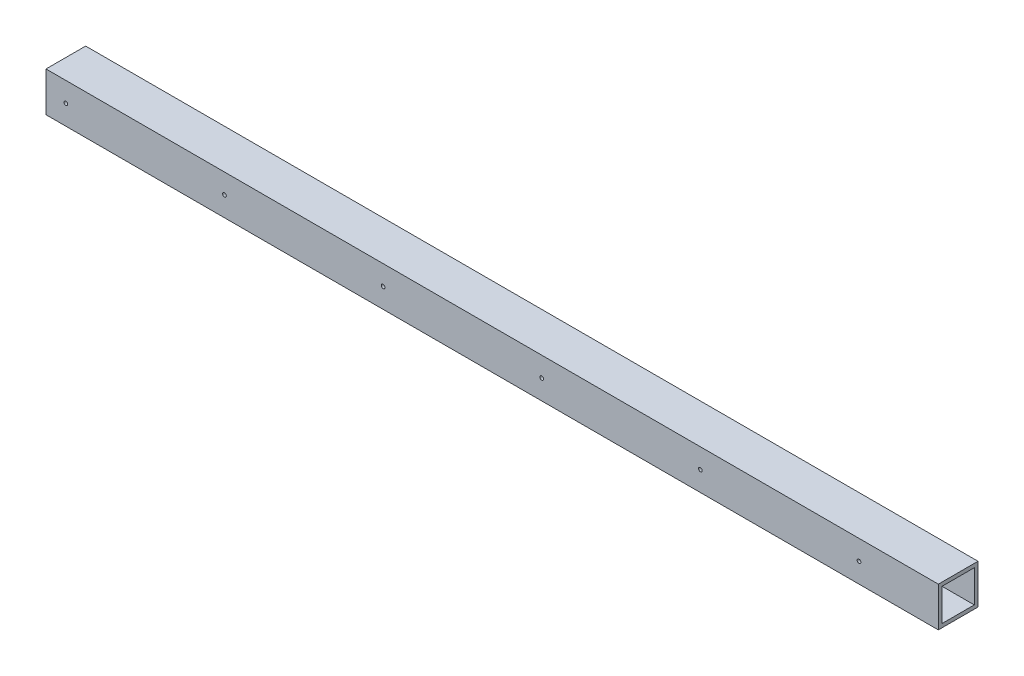
ISO-10303-21;
HEADER;
FILE_DESCRIPTION(('STEP AP214'),'2;1');
FILE_NAME('part.step','',(''),(''),'','','');
FILE_SCHEMA(('AUTOMOTIVE_DESIGN { 1 0 10303 214 1 1 1 1 }'));
ENDSEC;
DATA;
#1=APPLICATION_CONTEXT('core data for automotive mechanical design processes');
#2=APPLICATION_PROTOCOL_DEFINITION('international standard','automotive_design',2000,#1);
#3=PRODUCT_CONTEXT('',#1,'mechanical');
#4=PRODUCT('Part','Part','',(#3));
#5=PRODUCT_RELATED_PRODUCT_CATEGORY('part','',(#4));
#6=PRODUCT_DEFINITION_FORMATION('','',#4);
#7=PRODUCT_DEFINITION_CONTEXT('part definition',#1,'design');
#8=PRODUCT_DEFINITION('design','',#6,#7);
#9=PRODUCT_DEFINITION_SHAPE('','',#8);
#10=(LENGTH_UNIT() NAMED_UNIT(*) SI_UNIT(.MILLI.,.METRE.));
#11=(NAMED_UNIT(*) PLANE_ANGLE_UNIT() SI_UNIT($,.RADIAN.));
#12=(NAMED_UNIT(*) SI_UNIT($,.STERADIAN.) SOLID_ANGLE_UNIT());
#13=UNCERTAINTY_MEASURE_WITH_UNIT(LENGTH_MEASURE(1.E-05),#10,'distance_accuracy_value','');
#14=(GEOMETRIC_REPRESENTATION_CONTEXT(3) GLOBAL_UNCERTAINTY_ASSIGNED_CONTEXT((#13)) GLOBAL_UNIT_ASSIGNED_CONTEXT((#10,
#11,#12)) REPRESENTATION_CONTEXT('',''));
#15=CARTESIAN_POINT('',(0.,0.,0.));
#16=DIRECTION('',(0.,0.,1.));
#17=DIRECTION('',(1.,0.,0.));
#18=AXIS2_PLACEMENT_3D('',#15,#16,#17);
#19=CARTESIAN_POINT('',(25.4000000000001,25.4,0.));
#20=DIRECTION('',(0.,0.,-1.));
#21=DIRECTION('',(-1.,0.,0.));
#22=AXIS2_PLACEMENT_3D('',#19,#20,#21);
#23=CYLINDRICAL_SURFACE('',#22,2.38125000000006);
#24=CARTESIAN_POINT('',(25.4000000000001,25.4,-4.7625));
#25=DIRECTION('',(0.,0.,-1.));
#26=DIRECTION('',(-1.,0.,0.));
#27=AXIS2_PLACEMENT_3D('',#24,#25,#26);
#28=CIRCLE('',#27,2.38125000000006);
#29=CARTESIAN_POINT('',(23.01875,25.4,-4.7625));
#30=VERTEX_POINT('',#29);
#31=EDGE_CURVE('E39',#30,#30,#28,.T.);
#32=ORIENTED_EDGE('',*,*,#31,.T.);
#33=EDGE_LOOP('',(#32));
#34=FACE_BOUND('',#33,.T.);
#35=CARTESIAN_POINT('',(25.4000000000001,25.4,0.));
#36=DIRECTION('',(0.,0.,-1.));
#37=DIRECTION('',(-1.,0.,0.));
#38=AXIS2_PLACEMENT_3D('',#35,#36,#37);
#39=CIRCLE('',#38,2.38125000000006);
#40=CARTESIAN_POINT('',(23.01875,25.4,0.));
#41=VERTEX_POINT('',#40);
#42=EDGE_CURVE('E11',#41,#41,#39,.T.);
#43=ORIENTED_EDGE('',*,*,#42,.F.);
#44=EDGE_LOOP('',(#43));
#45=FACE_BOUND('',#44,.T.);
#46=ADVANCED_FACE('F32',(#34,#45),#23,.F.);
#47=CARTESIAN_POINT('',(228.6,25.4,0.));
#48=DIRECTION('',(0.,0.,-1.));
#49=DIRECTION('',(-1.,0.,0.));
#50=AXIS2_PLACEMENT_3D('',#47,#48,#49);
#51=CYLINDRICAL_SURFACE('',#50,2.38125000000006);
#52=CARTESIAN_POINT('',(228.6,25.4,-4.7625));
#53=DIRECTION('',(0.,0.,-1.));
#54=DIRECTION('',(-1.,0.,0.));
#55=AXIS2_PLACEMENT_3D('',#52,#53,#54);
#56=CIRCLE('',#55,2.38125000000006);
#57=CARTESIAN_POINT('',(226.21875,25.4,-4.7625));
#58=VERTEX_POINT('',#57);
#59=EDGE_CURVE('E205',#58,#58,#56,.T.);
#60=ORIENTED_EDGE('',*,*,#59,.T.);
#61=EDGE_LOOP('',(#60));
#62=FACE_BOUND('',#61,.T.);
#63=CARTESIAN_POINT('',(228.6,25.4,0.));
#64=DIRECTION('',(0.,0.,-1.));
#65=DIRECTION('',(-1.,0.,0.));
#66=AXIS2_PLACEMENT_3D('',#63,#64,#65);
#67=CIRCLE('',#66,2.38125000000006);
#68=CARTESIAN_POINT('',(226.21875,25.4,0.));
#69=VERTEX_POINT('',#68);
#70=EDGE_CURVE('E208',#69,#69,#67,.T.);
#71=ORIENTED_EDGE('',*,*,#70,.F.);
#72=EDGE_LOOP('',(#71));
#73=FACE_BOUND('',#72,.T.);
#74=ADVANCED_FACE('F233',(#62,#73),#51,.F.);
#75=CARTESIAN_POINT('',(431.8,25.4,0.));
#76=DIRECTION('',(0.,0.,-1.));
#77=DIRECTION('',(-1.,0.,0.));
#78=AXIS2_PLACEMENT_3D('',#75,#76,#77);
#79=CYLINDRICAL_SURFACE('',#78,2.38125000000006);
#80=CARTESIAN_POINT('',(431.8,25.4,-4.7625));
#81=DIRECTION('',(0.,0.,-1.));
#82=DIRECTION('',(-1.,0.,0.));
#83=AXIS2_PLACEMENT_3D('',#80,#81,#82);
#84=CIRCLE('',#83,2.38125000000006);
#85=CARTESIAN_POINT('',(429.41875,25.4,-4.7625));
#86=VERTEX_POINT('',#85);
#87=EDGE_CURVE('E199',#86,#86,#84,.T.);
#88=ORIENTED_EDGE('',*,*,#87,.T.);
#89=EDGE_LOOP('',(#88));
#90=FACE_BOUND('',#89,.T.);
#91=CARTESIAN_POINT('',(431.8,25.4,0.));
#92=DIRECTION('',(0.,0.,-1.));
#93=DIRECTION('',(-1.,0.,0.));
#94=AXIS2_PLACEMENT_3D('',#91,#92,#93);
#95=CIRCLE('',#94,2.38125000000006);
#96=CARTESIAN_POINT('',(429.41875,25.4,0.));
#97=VERTEX_POINT('',#96);
#98=EDGE_CURVE('E202',#97,#97,#95,.T.);
#99=ORIENTED_EDGE('',*,*,#98,.F.);
#100=EDGE_LOOP('',(#99));
#101=FACE_BOUND('',#100,.T.);
#102=ADVANCED_FACE('F237',(#90,#101),#79,.F.);
#103=CARTESIAN_POINT('',(635.,25.4,0.));
#104=DIRECTION('',(0.,0.,-1.));
#105=DIRECTION('',(-1.,0.,0.));
#106=AXIS2_PLACEMENT_3D('',#103,#104,#105);
#107=CYLINDRICAL_SURFACE('',#106,2.38125000000006);
#108=CARTESIAN_POINT('',(635.,25.4,-4.7625));
#109=DIRECTION('',(0.,0.,-1.));
#110=DIRECTION('',(-1.,0.,0.));
#111=AXIS2_PLACEMENT_3D('',#108,#109,#110);
#112=CIRCLE('',#111,2.38125000000006);
#113=CARTESIAN_POINT('',(632.61875,25.4,-4.7625));
#114=VERTEX_POINT('',#113);
#115=EDGE_CURVE('E193',#114,#114,#112,.T.);
#116=ORIENTED_EDGE('',*,*,#115,.T.);
#117=EDGE_LOOP('',(#116));
#118=FACE_BOUND('',#117,.T.);
#119=CARTESIAN_POINT('',(635.,25.4,0.));
#120=DIRECTION('',(0.,0.,-1.));
#121=DIRECTION('',(-1.,0.,0.));
#122=AXIS2_PLACEMENT_3D('',#119,#120,#121);
#123=CIRCLE('',#122,2.38125000000006);
#124=CARTESIAN_POINT('',(632.61875,25.4,0.));
#125=VERTEX_POINT('',#124);
#126=EDGE_CURVE('E196',#125,#125,#123,.T.);
#127=ORIENTED_EDGE('',*,*,#126,.F.);
#128=EDGE_LOOP('',(#127));
#129=FACE_BOUND('',#128,.T.);
#130=ADVANCED_FACE('F242',(#118,#129),#107,.F.);
#131=CARTESIAN_POINT('',(25.4000000000001,25.4,0.));
#132=DIRECTION('',(0.,0.,-1.));
#133=DIRECTION('',(-1.,0.,0.));
#134=AXIS2_PLACEMENT_3D('',#131,#132,#133);
#135=CYLINDRICAL_SURFACE('',#134,2.38125000000006);
#136=CARTESIAN_POINT('',(25.4000000000001,25.4,-46.0375));
#137=DIRECTION('',(0.,0.,1.));
#138=DIRECTION('',(1.,0.,0.));
#139=AXIS2_PLACEMENT_3D('',#136,#137,#138);
#140=CIRCLE('',#139,2.38125000000006);
#141=CARTESIAN_POINT('',(27.7812500000001,25.4,-46.0375));
#142=VERTEX_POINT('',#141);
#143=EDGE_CURVE('E187',#142,#142,#140,.T.);
#144=ORIENTED_EDGE('',*,*,#143,.T.);
#145=EDGE_LOOP('',(#144));
#146=FACE_BOUND('',#145,.T.);
#147=CARTESIAN_POINT('',(25.4000000000001,25.4,-50.8));
#148=DIRECTION('',(0.,0.,-1.));
#149=DIRECTION('',(-1.,0.,0.));
#150=AXIS2_PLACEMENT_3D('',#147,#148,#149);
#151=CIRCLE('',#150,2.38125000000006);
#152=CARTESIAN_POINT('',(23.01875,25.4,-50.8));
#153=VERTEX_POINT('',#152);
#154=EDGE_CURVE('E190',#153,#153,#151,.T.);
#155=ORIENTED_EDGE('',*,*,#154,.T.);
#156=EDGE_LOOP('',(#155));
#157=FACE_BOUND('',#156,.T.);
#158=ADVANCED_FACE('F249',(#146,#157),#135,.F.);
#159=CARTESIAN_POINT('',(228.6,25.4,0.));
#160=DIRECTION('',(0.,0.,-1.));
#161=DIRECTION('',(-1.,0.,0.));
#162=AXIS2_PLACEMENT_3D('',#159,#160,#161);
#163=CYLINDRICAL_SURFACE('',#162,2.38125000000006);
#164=CARTESIAN_POINT('',(228.6,25.4,-46.0375));
#165=DIRECTION('',(0.,0.,1.));
#166=DIRECTION('',(1.,0.,0.));
#167=AXIS2_PLACEMENT_3D('',#164,#165,#166);
#168=CIRCLE('',#167,2.38125000000006);
#169=CARTESIAN_POINT('',(230.98125,25.4,-46.0375));
#170=VERTEX_POINT('',#169);
#171=EDGE_CURVE('E181',#170,#170,#168,.T.);
#172=ORIENTED_EDGE('',*,*,#171,.T.);
#173=EDGE_LOOP('',(#172));
#174=FACE_BOUND('',#173,.T.);
#175=CARTESIAN_POINT('',(228.6,25.4,-50.8));
#176=DIRECTION('',(0.,0.,-1.));
#177=DIRECTION('',(-1.,0.,0.));
#178=AXIS2_PLACEMENT_3D('',#175,#176,#177);
#179=CIRCLE('',#178,2.38125000000006);
#180=CARTESIAN_POINT('',(226.21875,25.4,-50.8));
#181=VERTEX_POINT('',#180);
#182=EDGE_CURVE('E184',#181,#181,#179,.T.);
#183=ORIENTED_EDGE('',*,*,#182,.T.);
#184=EDGE_LOOP('',(#183));
#185=FACE_BOUND('',#184,.T.);
#186=ADVANCED_FACE('F253',(#174,#185),#163,.F.);
#187=CARTESIAN_POINT('',(431.8,25.4,0.));
#188=DIRECTION('',(0.,0.,-1.));
#189=DIRECTION('',(-1.,0.,0.));
#190=AXIS2_PLACEMENT_3D('',#187,#188,#189);
#191=CYLINDRICAL_SURFACE('',#190,2.38125000000006);
#192=CARTESIAN_POINT('',(431.8,25.4,-46.0375));
#193=DIRECTION('',(0.,0.,1.));
#194=DIRECTION('',(1.,0.,0.));
#195=AXIS2_PLACEMENT_3D('',#192,#193,#194);
#196=CIRCLE('',#195,2.38125000000006);
#197=CARTESIAN_POINT('',(434.18125,25.4,-46.0375));
#198=VERTEX_POINT('',#197);
#199=EDGE_CURVE('E175',#198,#198,#196,.T.);
#200=ORIENTED_EDGE('',*,*,#199,.T.);
#201=EDGE_LOOP('',(#200));
#202=FACE_BOUND('',#201,.T.);
#203=CARTESIAN_POINT('',(431.8,25.4,-50.8));
#204=DIRECTION('',(0.,0.,-1.));
#205=DIRECTION('',(-1.,0.,0.));
#206=AXIS2_PLACEMENT_3D('',#203,#204,#205);
#207=CIRCLE('',#206,2.38125000000006);
#208=CARTESIAN_POINT('',(429.41875,25.4,-50.8));
#209=VERTEX_POINT('',#208);
#210=EDGE_CURVE('E178',#209,#209,#207,.T.);
#211=ORIENTED_EDGE('',*,*,#210,.T.);
#212=EDGE_LOOP('',(#211));
#213=FACE_BOUND('',#212,.T.);
#214=ADVANCED_FACE('F257',(#202,#213),#191,.F.);
#215=CARTESIAN_POINT('',(635.,25.4,0.));
#216=DIRECTION('',(0.,0.,-1.));
#217=DIRECTION('',(-1.,0.,0.));
#218=AXIS2_PLACEMENT_3D('',#215,#216,#217);
#219=CYLINDRICAL_SURFACE('',#218,2.38125000000006);
#220=CARTESIAN_POINT('',(635.,25.4,-46.0375));
#221=DIRECTION('',(0.,0.,1.));
#222=DIRECTION('',(1.,0.,0.));
#223=AXIS2_PLACEMENT_3D('',#220,#221,#222);
#224=CIRCLE('',#223,2.38125000000006);
#225=CARTESIAN_POINT('',(637.38125,25.4,-46.0375));
#226=VERTEX_POINT('',#225);
#227=EDGE_CURVE('E165',#226,#226,#224,.T.);
#228=ORIENTED_EDGE('',*,*,#227,.T.);
#229=EDGE_LOOP('',(#228));
#230=FACE_BOUND('',#229,.T.);
#231=CARTESIAN_POINT('',(635.,25.4,-50.8));
#232=DIRECTION('',(0.,0.,-1.));
#233=DIRECTION('',(-1.,0.,0.));
#234=AXIS2_PLACEMENT_3D('',#231,#232,#233);
#235=CIRCLE('',#234,2.38125000000006);
#236=CARTESIAN_POINT('',(632.61875,25.4,-50.8));
#237=VERTEX_POINT('',#236);
#238=EDGE_CURVE('E172',#237,#237,#235,.T.);
#239=ORIENTED_EDGE('',*,*,#238,.T.);
#240=EDGE_LOOP('',(#239));
#241=FACE_BOUND('',#240,.T.);
#242=ADVANCED_FACE('F261',(#230,#241),#219,.F.);
#243=CARTESIAN_POINT('',(1143.,0.,0.));
#244=DIRECTION('',(-1.,0.,0.));
#245=DIRECTION('',(0.,0.,1.));
#246=AXIS2_PLACEMENT_3D('',#243,#244,#245);
#247=PLANE('',#246);
#248=DIRECTION('',(0.,-1.,0.));
#249=VECTOR('',#248,1.);
#250=CARTESIAN_POINT('',(1143.,0.,0.));
#251=LINE('',#250,#249);
#252=CARTESIAN_POINT('',(1143.,50.8,0.));
#253=VERTEX_POINT('',#252);
#254=CARTESIAN_POINT('',(1143.,0.,0.));
#255=VERTEX_POINT('',#254);
#256=EDGE_CURVE('E136',#253,#255,#251,.T.);
#257=ORIENTED_EDGE('',*,*,#256,.T.);
#258=DIRECTION('',(0.,0.,-1.));
#259=VECTOR('',#258,1.);
#260=CARTESIAN_POINT('',(1143.,0.,0.));
#261=LINE('',#260,#259);
#262=CARTESIAN_POINT('',(1143.,0.,-50.8));
#263=VERTEX_POINT('',#262);
#264=EDGE_CURVE('E139',#255,#263,#261,.T.);
#265=ORIENTED_EDGE('',*,*,#264,.T.);
#266=DIRECTION('',(0.,1.,0.));
#267=VECTOR('',#266,1.);
#268=CARTESIAN_POINT('',(1143.,0.,-50.8));
#269=LINE('',#268,#267);
#270=CARTESIAN_POINT('',(1143.,50.8,-50.8));
#271=VERTEX_POINT('',#270);
#272=EDGE_CURVE('E142',#263,#271,#269,.T.);
#273=ORIENTED_EDGE('',*,*,#272,.T.);
#274=DIRECTION('',(0.,0.,1.));
#275=VECTOR('',#274,1.);
#276=CARTESIAN_POINT('',(1143.,50.8,0.));
#277=LINE('',#276,#275);
#278=EDGE_CURVE('E144',#271,#253,#277,.T.);
#279=ORIENTED_EDGE('',*,*,#278,.T.);
#280=EDGE_LOOP('',(#257,#265,#273,#279));
#281=FACE_BOUND('',#280,.T.);
#282=DIRECTION('',(0.,0.,-1.));
#283=VECTOR('',#282,1.);
#284=CARTESIAN_POINT('',(1143.,4.7625,-4.7625));
#285=LINE('',#284,#283);
#286=CARTESIAN_POINT('',(1143.,4.7625,-4.7625));
#287=VERTEX_POINT('',#286);
#288=CARTESIAN_POINT('',(1143.,4.7625,-46.0375));
#289=VERTEX_POINT('',#288);
#290=EDGE_CURVE('E96',#287,#289,#285,.T.);
#291=ORIENTED_EDGE('',*,*,#290,.F.);
#292=DIRECTION('',(0.,-1.,0.));
#293=VECTOR('',#292,1.);
#294=CARTESIAN_POINT('',(1143.,4.7625,-4.7625));
#295=LINE('',#294,#293);
#296=CARTESIAN_POINT('',(1143.,46.0375,-4.7625));
#297=VERTEX_POINT('',#296);
#298=EDGE_CURVE('E120',#297,#287,#295,.T.);
#299=ORIENTED_EDGE('',*,*,#298,.F.);
#300=DIRECTION('',(0.,0.,1.));
#301=VECTOR('',#300,1.);
#302=CARTESIAN_POINT('',(1143.,46.0375,-4.7625));
#303=LINE('',#302,#301);
#304=CARTESIAN_POINT('',(1143.,46.0375,-46.0375));
#305=VERTEX_POINT('',#304);
#306=EDGE_CURVE('E118',#305,#297,#303,.T.);
#307=ORIENTED_EDGE('',*,*,#306,.F.);
#308=DIRECTION('',(0.,1.,0.));
#309=VECTOR('',#308,1.);
#310=CARTESIAN_POINT('',(1143.,4.7625,-46.0375));
#311=LINE('',#310,#309);
#312=EDGE_CURVE('E104',#289,#305,#311,.T.);
#313=ORIENTED_EDGE('',*,*,#312,.F.);
#314=EDGE_LOOP('',(#291,#299,#307,#313));
#315=FACE_BOUND('',#314,.T.);
#316=ADVANCED_FACE('F117',(#281,#315),#247,.F.);
#317=CARTESIAN_POINT('',(0.,0.,0.));
#318=DIRECTION('',(-1.,0.,0.));
#319=DIRECTION('',(0.,0.,1.));
#320=AXIS2_PLACEMENT_3D('',#317,#318,#319);
#321=PLANE('',#320);
#322=DIRECTION('',(0.,-1.,0.));
#323=VECTOR('',#322,1.);
#324=CARTESIAN_POINT('',(0.,0.,0.));
#325=LINE('',#324,#323);
#326=CARTESIAN_POINT('',(0.,50.8,0.));
#327=VERTEX_POINT('',#326);
#328=CARTESIAN_POINT('',(0.,0.,0.));
#329=VERTEX_POINT('',#328);
#330=EDGE_CURVE('E113',#327,#329,#325,.T.);
#331=ORIENTED_EDGE('',*,*,#330,.F.);
#332=DIRECTION('',(0.,0.,1.));
#333=VECTOR('',#332,1.);
#334=CARTESIAN_POINT('',(0.,50.8,0.));
#335=LINE('',#334,#333);
#336=CARTESIAN_POINT('',(0.,50.8,-50.8));
#337=VERTEX_POINT('',#336);
#338=EDGE_CURVE('E140',#337,#327,#335,.T.);
#339=ORIENTED_EDGE('',*,*,#338,.F.);
#340=DIRECTION('',(0.,1.,0.));
#341=VECTOR('',#340,1.);
#342=CARTESIAN_POINT('',(0.,0.,-50.8));
#343=LINE('',#342,#341);
#344=CARTESIAN_POINT('',(0.,0.,-50.8));
#345=VERTEX_POINT('',#344);
#346=EDGE_CURVE('E151',#345,#337,#343,.T.);
#347=ORIENTED_EDGE('',*,*,#346,.F.);
#348=DIRECTION('',(0.,0.,-1.));
#349=VECTOR('',#348,1.);
#350=CARTESIAN_POINT('',(0.,0.,0.));
#351=LINE('',#350,#349);
#352=EDGE_CURVE('E149',#329,#345,#351,.T.);
#353=ORIENTED_EDGE('',*,*,#352,.F.);
#354=EDGE_LOOP('',(#331,#339,#347,#353));
#355=FACE_BOUND('',#354,.T.);
#356=DIRECTION('',(0.,-1.,0.));
#357=VECTOR('',#356,1.);
#358=CARTESIAN_POINT('',(0.,4.7625,-4.7625));
#359=LINE('',#358,#357);
#360=CARTESIAN_POINT('',(0.,46.0375,-4.7625));
#361=VERTEX_POINT('',#360);
#362=CARTESIAN_POINT('',(0.,4.7625,-4.7625));
#363=VERTEX_POINT('',#362);
#364=EDGE_CURVE('E105',#361,#363,#359,.T.);
#365=ORIENTED_EDGE('',*,*,#364,.T.);
#366=DIRECTION('',(0.,0.,-1.));
#367=VECTOR('',#366,1.);
#368=CARTESIAN_POINT('',(0.,4.7625,-4.7625));
#369=LINE('',#368,#367);
#370=CARTESIAN_POINT('',(0.,4.7625,-46.0375));
#371=VERTEX_POINT('',#370);
#372=EDGE_CURVE('E54',#363,#371,#369,.T.);
#373=ORIENTED_EDGE('',*,*,#372,.T.);
#374=DIRECTION('',(0.,1.,0.));
#375=VECTOR('',#374,1.);
#376=CARTESIAN_POINT('',(0.,4.7625,-46.0375));
#377=LINE('',#376,#375);
#378=CARTESIAN_POINT('',(0.,46.0375,-46.0375));
#379=VERTEX_POINT('',#378);
#380=EDGE_CURVE('E112',#371,#379,#377,.T.);
#381=ORIENTED_EDGE('',*,*,#380,.T.);
#382=DIRECTION('',(0.,0.,1.));
#383=VECTOR('',#382,1.);
#384=CARTESIAN_POINT('',(0.,46.0375,-4.7625));
#385=LINE('',#384,#383);
#386=EDGE_CURVE('E128',#379,#361,#385,.T.);
#387=ORIENTED_EDGE('',*,*,#386,.T.);
#388=EDGE_LOOP('',(#365,#373,#381,#387));
#389=FACE_BOUND('',#388,.T.);
#390=ADVANCED_FACE('F270',(#355,#389),#321,.T.);
#391=CARTESIAN_POINT('',(1143.,0.,0.));
#392=DIRECTION('',(0.,0.,-1.));
#393=DIRECTION('',(-1.,0.,0.));
#394=AXIS2_PLACEMENT_3D('',#391,#392,#393);
#395=PLANE('',#394);
#396=CARTESIAN_POINT('',(838.2,25.4,0.));
#397=DIRECTION('',(0.,0.,-1.));
#398=DIRECTION('',(-1.,0.,0.));
#399=AXIS2_PLACEMENT_3D('',#396,#397,#398);
#400=CIRCLE('',#399,2.38125000000006);
#401=CARTESIAN_POINT('',(835.81875,25.4,0.));
#402=VERTEX_POINT('',#401);
#403=EDGE_CURVE('E313',#402,#402,#400,.T.);
#404=ORIENTED_EDGE('',*,*,#403,.T.);
#405=EDGE_LOOP('',(#404));
#406=FACE_BOUND('',#405,.T.);
#407=CARTESIAN_POINT('',(1041.4,25.4,0.));
#408=DIRECTION('',(0.,0.,-1.));
#409=DIRECTION('',(-1.,0.,0.));
#410=AXIS2_PLACEMENT_3D('',#407,#408,#409);
#411=CIRCLE('',#410,2.38125000000006);
#412=CARTESIAN_POINT('',(1039.01875,25.4,0.));
#413=VERTEX_POINT('',#412);
#414=EDGE_CURVE('E169',#413,#413,#411,.T.);
#415=ORIENTED_EDGE('',*,*,#414,.T.);
#416=EDGE_LOOP('',(#415));
#417=FACE_BOUND('',#416,.T.);
#418=ORIENTED_EDGE('',*,*,#330,.T.);
#419=DIRECTION('',(-1.,0.,0.));
#420=VECTOR('',#419,1.);
#421=CARTESIAN_POINT('',(1143.,0.,0.));
#422=LINE('',#421,#420);
#423=EDGE_CURVE('E162',#255,#329,#422,.T.);
#424=ORIENTED_EDGE('',*,*,#423,.F.);
#425=ORIENTED_EDGE('',*,*,#256,.F.);
#426=DIRECTION('',(-1.,0.,0.));
#427=VECTOR('',#426,1.);
#428=CARTESIAN_POINT('',(1143.,50.8,0.));
#429=LINE('',#428,#427);
#430=EDGE_CURVE('E146',#253,#327,#429,.T.);
#431=ORIENTED_EDGE('',*,*,#430,.T.);
#432=EDGE_LOOP('',(#418,#424,#425,#431));
#433=FACE_BOUND('',#432,.T.);
#434=ORIENTED_EDGE('',*,*,#126,.T.);
#435=EDGE_LOOP('',(#434));
#436=FACE_BOUND('',#435,.T.);
#437=ORIENTED_EDGE('',*,*,#98,.T.);
#438=EDGE_LOOP('',(#437));
#439=FACE_BOUND('',#438,.T.);
#440=ORIENTED_EDGE('',*,*,#70,.T.);
#441=EDGE_LOOP('',(#440));
#442=FACE_BOUND('',#441,.T.);
#443=ORIENTED_EDGE('',*,*,#42,.T.);
#444=EDGE_LOOP('',(#443));
#445=FACE_BOUND('',#444,.T.);
#446=ADVANCED_FACE('F266',(#406,#417,#433,#436,#439,#442,#445),#395,.F.);
#447=CARTESIAN_POINT('',(1143.,0.,0.));
#448=DIRECTION('',(0.,1.,0.));
#449=DIRECTION('',(0.,0.,1.));
#450=AXIS2_PLACEMENT_3D('',#447,#448,#449);
#451=PLANE('',#450);
#452=CARTESIAN_POINT('',(304.8,0.,-25.4));
#453=DIRECTION('',(0.,-1.,0.));
#454=DIRECTION('',(0.,0.,-1.));
#455=AXIS2_PLACEMENT_3D('',#452,#453,#454);
#456=CIRCLE('',#455,2.38125000000001);
#457=CARTESIAN_POINT('',(304.8,0.,-27.78125));
#458=VERTEX_POINT('',#457);
#459=EDGE_CURVE('E348',#458,#458,#456,.T.);
#460=ORIENTED_EDGE('',*,*,#459,.F.);
#461=EDGE_LOOP('',(#460));
#462=FACE_BOUND('',#461,.T.);
#463=CARTESIAN_POINT('',(508.,0.,-25.4));
#464=DIRECTION('',(0.,-1.,0.));
#465=DIRECTION('',(0.,0.,-1.));
#466=AXIS2_PLACEMENT_3D('',#463,#464,#465);
#467=CIRCLE('',#466,2.38125000000001);
#468=CARTESIAN_POINT('',(508.,0.,-27.78125));
#469=VERTEX_POINT('',#468);
#470=EDGE_CURVE('E342',#469,#469,#467,.T.);
#471=ORIENTED_EDGE('',*,*,#470,.F.);
#472=EDGE_LOOP('',(#471));
#473=FACE_BOUND('',#472,.T.);
#474=CARTESIAN_POINT('',(711.2,0.,-25.4));
#475=DIRECTION('',(0.,-1.,0.));
#476=DIRECTION('',(0.,0.,-1.));
#477=AXIS2_PLACEMENT_3D('',#474,#475,#476);
#478=CIRCLE('',#477,2.38125000000001);
#479=CARTESIAN_POINT('',(711.2,0.,-27.78125));
#480=VERTEX_POINT('',#479);
#481=EDGE_CURVE('E336',#480,#480,#478,.T.);
#482=ORIENTED_EDGE('',*,*,#481,.F.);
#483=EDGE_LOOP('',(#482));
#484=FACE_BOUND('',#483,.T.);
#485=CARTESIAN_POINT('',(914.4,0.,-25.4));
#486=DIRECTION('',(0.,-1.,0.));
#487=DIRECTION('',(0.,0.,-1.));
#488=AXIS2_PLACEMENT_3D('',#485,#486,#487);
#489=CIRCLE('',#488,2.38125000000001);
#490=CARTESIAN_POINT('',(914.4,0.,-27.78125));
#491=VERTEX_POINT('',#490);
#492=EDGE_CURVE('E329',#491,#491,#489,.T.);
#493=ORIENTED_EDGE('',*,*,#492,.F.);
#494=EDGE_LOOP('',(#493));
#495=FACE_BOUND('',#494,.T.);
#496=CARTESIAN_POINT('',(1117.6,0.,-25.4));
#497=DIRECTION('',(0.,-1.,0.));
#498=DIRECTION('',(0.,0.,-1.));
#499=AXIS2_PLACEMENT_3D('',#496,#497,#498);
#500=CIRCLE('',#499,2.38125000000001);
#501=CARTESIAN_POINT('',(1117.6,0.,-27.78125));
#502=VERTEX_POINT('',#501);
#503=EDGE_CURVE('E330',#502,#502,#500,.T.);
#504=ORIENTED_EDGE('',*,*,#503,.F.);
#505=EDGE_LOOP('',(#504));
#506=FACE_BOUND('',#505,.T.);
#507=CARTESIAN_POINT('',(101.6,0.,-25.4));
#508=DIRECTION('',(0.,-1.,0.));
#509=DIRECTION('',(0.,0.,-1.));
#510=AXIS2_PLACEMENT_3D('',#507,#508,#509);
#511=CIRCLE('',#510,2.38125000000001);
#512=CARTESIAN_POINT('',(101.6,0.,-27.78125));
#513=VERTEX_POINT('',#512);
#514=EDGE_CURVE('E322',#513,#513,#511,.T.);
#515=ORIENTED_EDGE('',*,*,#514,.F.);
#516=EDGE_LOOP('',(#515));
#517=FACE_BOUND('',#516,.T.);
#518=ORIENTED_EDGE('',*,*,#352,.T.);
#519=DIRECTION('',(-1.,0.,0.));
#520=VECTOR('',#519,1.);
#521=CARTESIAN_POINT('',(1143.,0.,-50.8));
#522=LINE('',#521,#520);
#523=EDGE_CURVE('E159',#263,#345,#522,.T.);
#524=ORIENTED_EDGE('',*,*,#523,.F.);
#525=ORIENTED_EDGE('',*,*,#264,.F.);
#526=ORIENTED_EDGE('',*,*,#423,.T.);
#527=EDGE_LOOP('',(#518,#524,#525,#526));
#528=FACE_BOUND('',#527,.T.);
#529=ADVANCED_FACE('F269',(#462,#473,#484,#495,#506,#517,#528),#451,.F.);
#530=CARTESIAN_POINT('',(1143.,0.,-50.8));
#531=DIRECTION('',(0.,0.,1.));
#532=DIRECTION('',(1.,0.,0.));
#533=AXIS2_PLACEMENT_3D('',#530,#531,#532);
#534=PLANE('',#533);
#535=CARTESIAN_POINT('',(838.2,25.4,-50.8));
#536=DIRECTION('',(0.,0.,-1.));
#537=DIRECTION('',(-1.,0.,0.));
#538=AXIS2_PLACEMENT_3D('',#535,#536,#537);
#539=CIRCLE('',#538,2.38125000000006);
#540=CARTESIAN_POINT('',(835.81875,25.4,-50.8));
#541=VERTEX_POINT('',#540);
#542=EDGE_CURVE('E307',#541,#541,#539,.T.);
#543=ORIENTED_EDGE('',*,*,#542,.F.);
#544=EDGE_LOOP('',(#543));
#545=FACE_BOUND('',#544,.T.);
#546=CARTESIAN_POINT('',(1041.4,25.4,-50.8));
#547=DIRECTION('',(0.,0.,-1.));
#548=DIRECTION('',(-1.,0.,0.));
#549=AXIS2_PLACEMENT_3D('',#546,#547,#548);
#550=CIRCLE('',#549,2.38125000000006);
#551=CARTESIAN_POINT('',(1039.01875,25.4,-50.8));
#552=VERTEX_POINT('',#551);
#553=EDGE_CURVE('E304',#552,#552,#550,.T.);
#554=ORIENTED_EDGE('',*,*,#553,.F.);
#555=EDGE_LOOP('',(#554));
#556=FACE_BOUND('',#555,.T.);
#557=ORIENTED_EDGE('',*,*,#346,.T.);
#558=DIRECTION('',(-1.,0.,0.));
#559=VECTOR('',#558,1.);
#560=CARTESIAN_POINT('',(1143.,50.8,-50.8));
#561=LINE('',#560,#559);
#562=EDGE_CURVE('E156',#271,#337,#561,.T.);
#563=ORIENTED_EDGE('',*,*,#562,.F.);
#564=ORIENTED_EDGE('',*,*,#272,.F.);
#565=ORIENTED_EDGE('',*,*,#523,.T.);
#566=EDGE_LOOP('',(#557,#563,#564,#565));
#567=FACE_BOUND('',#566,.T.);
#568=ORIENTED_EDGE('',*,*,#238,.F.);
#569=EDGE_LOOP('',(#568));
#570=FACE_BOUND('',#569,.T.);
#571=ORIENTED_EDGE('',*,*,#210,.F.);
#572=EDGE_LOOP('',(#571));
#573=FACE_BOUND('',#572,.T.);
#574=ORIENTED_EDGE('',*,*,#182,.F.);
#575=EDGE_LOOP('',(#574));
#576=FACE_BOUND('',#575,.T.);
#577=ORIENTED_EDGE('',*,*,#154,.F.);
#578=EDGE_LOOP('',(#577));
#579=FACE_BOUND('',#578,.T.);
#580=ADVANCED_FACE('F274',(#545,#556,#567,#570,#573,#576,#579),#534,.F.);
#581=CARTESIAN_POINT('',(1143.,50.8,0.));
#582=DIRECTION('',(0.,-1.,0.));
#583=DIRECTION('',(0.,0.,-1.));
#584=AXIS2_PLACEMENT_3D('',#581,#582,#583);
#585=PLANE('',#584);
#586=ORIENTED_EDGE('',*,*,#338,.T.);
#587=ORIENTED_EDGE('',*,*,#430,.F.);
#588=ORIENTED_EDGE('',*,*,#278,.F.);
#589=ORIENTED_EDGE('',*,*,#562,.T.);
#590=EDGE_LOOP('',(#586,#587,#588,#589));
#591=FACE_BOUND('',#590,.T.);
#592=ADVANCED_FACE('F278',(#591),#585,.F.);
#593=CARTESIAN_POINT('',(1143.,4.7625,-4.7625));
#594=DIRECTION('',(0.,1.,0.));
#595=DIRECTION('',(0.,0.,1.));
#596=AXIS2_PLACEMENT_3D('',#593,#594,#595);
#597=PLANE('',#596);
#598=CARTESIAN_POINT('',(304.8,4.7625,-25.4));
#599=DIRECTION('',(0.,1.,0.));
#600=DIRECTION('',(0.,0.,1.));
#601=AXIS2_PLACEMENT_3D('',#598,#599,#600);
#602=CIRCLE('',#601,2.38125000000001);
#603=CARTESIAN_POINT('',(304.8,4.7625,-23.01875));
#604=VERTEX_POINT('',#603);
#605=EDGE_CURVE('E325',#604,#604,#602,.F.);
#606=ORIENTED_EDGE('',*,*,#605,.T.);
#607=EDGE_LOOP('',(#606));
#608=FACE_BOUND('',#607,.T.);
#609=CARTESIAN_POINT('',(508.,4.7625,-25.4));
#610=DIRECTION('',(0.,1.,0.));
#611=DIRECTION('',(0.,0.,1.));
#612=AXIS2_PLACEMENT_3D('',#609,#610,#611);
#613=CIRCLE('',#612,2.38125000000001);
#614=CARTESIAN_POINT('',(508.,4.7625,-23.01875));
#615=VERTEX_POINT('',#614);
#616=EDGE_CURVE('E345',#615,#615,#613,.F.);
#617=ORIENTED_EDGE('',*,*,#616,.T.);
#618=EDGE_LOOP('',(#617));
#619=FACE_BOUND('',#618,.T.);
#620=CARTESIAN_POINT('',(711.2,4.7625,-25.4));
#621=DIRECTION('',(0.,1.,0.));
#622=DIRECTION('',(0.,0.,1.));
#623=AXIS2_PLACEMENT_3D('',#620,#621,#622);
#624=CIRCLE('',#623,2.38125000000001);
#625=CARTESIAN_POINT('',(711.2,4.7625,-23.01875));
#626=VERTEX_POINT('',#625);
#627=EDGE_CURVE('E339',#626,#626,#624,.F.);
#628=ORIENTED_EDGE('',*,*,#627,.T.);
#629=EDGE_LOOP('',(#628));
#630=FACE_BOUND('',#629,.T.);
#631=CARTESIAN_POINT('',(914.4,4.7625,-25.4));
#632=DIRECTION('',(0.,1.,0.));
#633=DIRECTION('',(0.,0.,1.));
#634=AXIS2_PLACEMENT_3D('',#631,#632,#633);
#635=CIRCLE('',#634,2.38125000000001);
#636=CARTESIAN_POINT('',(914.4,4.7625,-23.01875));
#637=VERTEX_POINT('',#636);
#638=EDGE_CURVE('E333',#637,#637,#635,.F.);
#639=ORIENTED_EDGE('',*,*,#638,.T.);
#640=EDGE_LOOP('',(#639));
#641=FACE_BOUND('',#640,.T.);
#642=CARTESIAN_POINT('',(1117.6,4.7625,-25.4));
#643=DIRECTION('',(0.,1.,0.));
#644=DIRECTION('',(0.,0.,1.));
#645=AXIS2_PLACEMENT_3D('',#642,#643,#644);
#646=CIRCLE('',#645,2.38125000000001);
#647=CARTESIAN_POINT('',(1117.6,4.7625,-23.01875));
#648=VERTEX_POINT('',#647);
#649=EDGE_CURVE('E326',#648,#648,#646,.F.);
#650=ORIENTED_EDGE('',*,*,#649,.T.);
#651=EDGE_LOOP('',(#650));
#652=FACE_BOUND('',#651,.T.);
#653=CARTESIAN_POINT('',(101.6,4.7625,-25.4));
#654=DIRECTION('',(0.,1.,0.));
#655=DIRECTION('',(0.,0.,1.));
#656=AXIS2_PLACEMENT_3D('',#653,#654,#655);
#657=CIRCLE('',#656,2.38125000000001);
#658=CARTESIAN_POINT('',(101.6,4.7625,-23.01875));
#659=VERTEX_POINT('',#658);
#660=EDGE_CURVE('E319',#659,#659,#657,.F.);
#661=ORIENTED_EDGE('',*,*,#660,.T.);
#662=EDGE_LOOP('',(#661));
#663=FACE_BOUND('',#662,.T.);
#664=ORIENTED_EDGE('',*,*,#372,.F.);
#665=DIRECTION('',(-1.,0.,0.));
#666=VECTOR('',#665,1.);
#667=CARTESIAN_POINT('',(1143.,4.7625,-4.7625));
#668=LINE('',#667,#666);
#669=EDGE_CURVE('E100',#287,#363,#668,.T.);
#670=ORIENTED_EDGE('',*,*,#669,.F.);
#671=ORIENTED_EDGE('',*,*,#290,.T.);
#672=DIRECTION('',(-1.,0.,0.));
#673=VECTOR('',#672,1.);
#674=CARTESIAN_POINT('',(1143.,4.7625,-46.0375));
#675=LINE('',#674,#673);
#676=EDGE_CURVE('E99',#289,#371,#675,.T.);
#677=ORIENTED_EDGE('',*,*,#676,.T.);
#678=EDGE_LOOP('',(#664,#670,#671,#677));
#679=FACE_BOUND('',#678,.T.);
#680=ADVANCED_FACE('F98',(#608,#619,#630,#641,#652,#663,#679),#597,.T.);
#681=CARTESIAN_POINT('',(1143.,4.7625,-46.0375));
#682=DIRECTION('',(0.,0.,1.));
#683=DIRECTION('',(1.,0.,0.));
#684=AXIS2_PLACEMENT_3D('',#681,#682,#683);
#685=PLANE('',#684);
#686=CARTESIAN_POINT('',(838.2,25.4,-46.0375));
#687=DIRECTION('',(0.,0.,1.));
#688=DIRECTION('',(1.,0.,0.));
#689=AXIS2_PLACEMENT_3D('',#686,#687,#688);
#690=CIRCLE('',#689,2.38125000000006);
#691=CARTESIAN_POINT('',(840.58125,25.4,-46.0375));
#692=VERTEX_POINT('',#691);
#693=EDGE_CURVE('E299',#692,#692,#690,.T.);
#694=ORIENTED_EDGE('',*,*,#693,.F.);
#695=EDGE_LOOP('',(#694));
#696=FACE_BOUND('',#695,.T.);
#697=CARTESIAN_POINT('',(1041.4,25.4,-46.0375));
#698=DIRECTION('',(0.,0.,1.));
#699=DIRECTION('',(1.,0.,0.));
#700=AXIS2_PLACEMENT_3D('',#697,#698,#699);
#701=CIRCLE('',#700,2.38125000000006);
#702=CARTESIAN_POINT('',(1043.78125,25.4,-46.0375));
#703=VERTEX_POINT('',#702);
#704=EDGE_CURVE('E126',#703,#703,#701,.T.);
#705=ORIENTED_EDGE('',*,*,#704,.F.);
#706=EDGE_LOOP('',(#705));
#707=FACE_BOUND('',#706,.T.);
#708=ORIENTED_EDGE('',*,*,#380,.F.);
#709=ORIENTED_EDGE('',*,*,#676,.F.);
#710=ORIENTED_EDGE('',*,*,#312,.T.);
#711=DIRECTION('',(-1.,0.,0.));
#712=VECTOR('',#711,1.);
#713=CARTESIAN_POINT('',(1143.,46.0375,-46.0375));
#714=LINE('',#713,#712);
#715=EDGE_CURVE('E114',#305,#379,#714,.T.);
#716=ORIENTED_EDGE('',*,*,#715,.T.);
#717=EDGE_LOOP('',(#708,#709,#710,#716));
#718=FACE_BOUND('',#717,.T.);
#719=ORIENTED_EDGE('',*,*,#227,.F.);
#720=EDGE_LOOP('',(#719));
#721=FACE_BOUND('',#720,.T.);
#722=ORIENTED_EDGE('',*,*,#199,.F.);
#723=EDGE_LOOP('',(#722));
#724=FACE_BOUND('',#723,.T.);
#725=ORIENTED_EDGE('',*,*,#171,.F.);
#726=EDGE_LOOP('',(#725));
#727=FACE_BOUND('',#726,.T.);
#728=ORIENTED_EDGE('',*,*,#143,.F.);
#729=EDGE_LOOP('',(#728));
#730=FACE_BOUND('',#729,.T.);
#731=ADVANCED_FACE('F108',(#696,#707,#718,#721,#724,#727,#730),#685,.T.);
#732=CARTESIAN_POINT('',(1143.,46.0375,-4.7625));
#733=DIRECTION('',(0.,-1.,0.));
#734=DIRECTION('',(0.,0.,-1.));
#735=AXIS2_PLACEMENT_3D('',#732,#733,#734);
#736=PLANE('',#735);
#737=ORIENTED_EDGE('',*,*,#386,.F.);
#738=ORIENTED_EDGE('',*,*,#715,.F.);
#739=ORIENTED_EDGE('',*,*,#306,.T.);
#740=DIRECTION('',(-1.,0.,0.));
#741=VECTOR('',#740,1.);
#742=CARTESIAN_POINT('',(1143.,46.0375,-4.7625));
#743=LINE('',#742,#741);
#744=EDGE_CURVE('E46',#297,#361,#743,.T.);
#745=ORIENTED_EDGE('',*,*,#744,.T.);
#746=EDGE_LOOP('',(#737,#738,#739,#745));
#747=FACE_BOUND('',#746,.T.);
#748=ADVANCED_FACE('F218',(#747),#736,.T.);
#749=CARTESIAN_POINT('',(1143.,4.7625,-4.7625));
#750=DIRECTION('',(0.,0.,-1.));
#751=DIRECTION('',(-1.,0.,0.));
#752=AXIS2_PLACEMENT_3D('',#749,#750,#751);
#753=PLANE('',#752);
#754=CARTESIAN_POINT('',(838.2,25.4,-4.7625));
#755=DIRECTION('',(0.,0.,-1.));
#756=DIRECTION('',(-1.,0.,0.));
#757=AXIS2_PLACEMENT_3D('',#754,#755,#756);
#758=CIRCLE('',#757,2.38125000000006);
#759=CARTESIAN_POINT('',(835.81875,25.4,-4.7625));
#760=VERTEX_POINT('',#759);
#761=EDGE_CURVE('E316',#760,#760,#758,.T.);
#762=ORIENTED_EDGE('',*,*,#761,.F.);
#763=EDGE_LOOP('',(#762));
#764=FACE_BOUND('',#763,.T.);
#765=CARTESIAN_POINT('',(1041.4,25.4,-4.7625));
#766=DIRECTION('',(0.,0.,-1.));
#767=DIRECTION('',(-1.,0.,0.));
#768=AXIS2_PLACEMENT_3D('',#765,#766,#767);
#769=CIRCLE('',#768,2.38125000000006);
#770=CARTESIAN_POINT('',(1039.01875,25.4,-4.7625));
#771=VERTEX_POINT('',#770);
#772=EDGE_CURVE('E166',#771,#771,#769,.T.);
#773=ORIENTED_EDGE('',*,*,#772,.F.);
#774=EDGE_LOOP('',(#773));
#775=FACE_BOUND('',#774,.T.);
#776=ORIENTED_EDGE('',*,*,#364,.F.);
#777=ORIENTED_EDGE('',*,*,#744,.F.);
#778=ORIENTED_EDGE('',*,*,#298,.T.);
#779=ORIENTED_EDGE('',*,*,#669,.T.);
#780=EDGE_LOOP('',(#776,#777,#778,#779));
#781=FACE_BOUND('',#780,.T.);
#782=ORIENTED_EDGE('',*,*,#115,.F.);
#783=EDGE_LOOP('',(#782));
#784=FACE_BOUND('',#783,.T.);
#785=ORIENTED_EDGE('',*,*,#87,.F.);
#786=EDGE_LOOP('',(#785));
#787=FACE_BOUND('',#786,.T.);
#788=ORIENTED_EDGE('',*,*,#59,.F.);
#789=EDGE_LOOP('',(#788));
#790=FACE_BOUND('',#789,.T.);
#791=ORIENTED_EDGE('',*,*,#31,.F.);
#792=EDGE_LOOP('',(#791));
#793=FACE_BOUND('',#792,.T.);
#794=ADVANCED_FACE('F215',(#764,#775,#781,#784,#787,#790,#793),#753,.T.);
#795=CARTESIAN_POINT('',(1041.4,25.4,0.));
#796=DIRECTION('',(0.,0.,-1.));
#797=DIRECTION('',(-1.,0.,0.));
#798=AXIS2_PLACEMENT_3D('',#795,#796,#797);
#799=CYLINDRICAL_SURFACE('',#798,2.38125000000006);
#800=ORIENTED_EDGE('',*,*,#772,.T.);
#801=EDGE_LOOP('',(#800));
#802=FACE_BOUND('',#801,.T.);
#803=ORIENTED_EDGE('',*,*,#414,.F.);
#804=EDGE_LOOP('',(#803));
#805=FACE_BOUND('',#804,.T.);
#806=ADVANCED_FACE('F217',(#802,#805),#799,.F.);
#807=ORIENTED_EDGE('',*,*,#704,.T.);
#808=EDGE_LOOP('',(#807));
#809=FACE_BOUND('',#808,.T.);
#810=ORIENTED_EDGE('',*,*,#553,.T.);
#811=EDGE_LOOP('',(#810));
#812=FACE_BOUND('',#811,.T.);
#813=ADVANCED_FACE('F225',(#809,#812),#799,.F.);
#814=CARTESIAN_POINT('',(838.2,25.4,0.));
#815=DIRECTION('',(0.,0.,-1.));
#816=DIRECTION('',(-1.,0.,0.));
#817=AXIS2_PLACEMENT_3D('',#814,#815,#816);
#818=CYLINDRICAL_SURFACE('',#817,2.38125000000006);
#819=ORIENTED_EDGE('',*,*,#693,.T.);
#820=EDGE_LOOP('',(#819));
#821=FACE_BOUND('',#820,.T.);
#822=ORIENTED_EDGE('',*,*,#542,.T.);
#823=EDGE_LOOP('',(#822));
#824=FACE_BOUND('',#823,.T.);
#825=ADVANCED_FACE('F427',(#821,#824),#818,.F.);
#826=CARTESIAN_POINT('',(838.2,25.4,0.));
#827=DIRECTION('',(0.,0.,-1.));
#828=DIRECTION('',(-1.,0.,0.));
#829=AXIS2_PLACEMENT_3D('',#826,#827,#828);
#830=CYLINDRICAL_SURFACE('',#829,2.38125000000006);
#831=ORIENTED_EDGE('',*,*,#761,.T.);
#832=EDGE_LOOP('',(#831));
#833=FACE_BOUND('',#832,.T.);
#834=ORIENTED_EDGE('',*,*,#403,.F.);
#835=EDGE_LOOP('',(#834));
#836=FACE_BOUND('',#835,.T.);
#837=ADVANCED_FACE('F416',(#833,#836),#830,.F.);
#838=CARTESIAN_POINT('',(101.6,11.4976920908019,-25.4));
#839=DIRECTION('',(0.,-1.,0.));
#840=DIRECTION('',(0.,0.,-1.));
#841=AXIS2_PLACEMENT_3D('',#838,#839,#840);
#842=CYLINDRICAL_SURFACE('',#841,2.38125000000001);
#843=ORIENTED_EDGE('',*,*,#514,.T.);
#844=EDGE_LOOP('',(#843));
#845=FACE_BOUND('',#844,.T.);
#846=ORIENTED_EDGE('',*,*,#660,.F.);
#847=EDGE_LOOP('',(#846));
#848=FACE_BOUND('',#847,.T.);
#849=ADVANCED_FACE('F412',(#845,#848),#842,.F.);
#850=CARTESIAN_POINT('',(1117.6,11.4976920908019,-25.4));
#851=DIRECTION('',(0.,-1.,0.));
#852=DIRECTION('',(0.,0.,-1.));
#853=AXIS2_PLACEMENT_3D('',#850,#851,#852);
#854=CYLINDRICAL_SURFACE('',#853,2.38125000000001);
#855=ORIENTED_EDGE('',*,*,#503,.T.);
#856=EDGE_LOOP('',(#855));
#857=FACE_BOUND('',#856,.T.);
#858=ORIENTED_EDGE('',*,*,#649,.F.);
#859=EDGE_LOOP('',(#858));
#860=FACE_BOUND('',#859,.T.);
#861=ADVANCED_FACE('F415',(#857,#860),#854,.F.);
#862=CARTESIAN_POINT('',(914.4,11.4976920908019,-25.4));
#863=DIRECTION('',(0.,-1.,0.));
#864=DIRECTION('',(0.,0.,-1.));
#865=AXIS2_PLACEMENT_3D('',#862,#863,#864);
#866=CYLINDRICAL_SURFACE('',#865,2.38125000000001);
#867=ORIENTED_EDGE('',*,*,#492,.T.);
#868=EDGE_LOOP('',(#867));
#869=FACE_BOUND('',#868,.T.);
#870=ORIENTED_EDGE('',*,*,#638,.F.);
#871=EDGE_LOOP('',(#870));
#872=FACE_BOUND('',#871,.T.);
#873=ADVANCED_FACE('F424',(#869,#872),#866,.F.);
#874=CARTESIAN_POINT('',(711.2,11.4976920908019,-25.4));
#875=DIRECTION('',(0.,-1.,0.));
#876=DIRECTION('',(0.,0.,-1.));
#877=AXIS2_PLACEMENT_3D('',#874,#875,#876);
#878=CYLINDRICAL_SURFACE('',#877,2.38125000000001);
#879=ORIENTED_EDGE('',*,*,#481,.T.);
#880=EDGE_LOOP('',(#879));
#881=FACE_BOUND('',#880,.T.);
#882=ORIENTED_EDGE('',*,*,#627,.F.);
#883=EDGE_LOOP('',(#882));
#884=FACE_BOUND('',#883,.T.);
#885=ADVANCED_FACE('F554',(#881,#884),#878,.F.);
#886=CARTESIAN_POINT('',(508.,11.4976920908019,-25.4));
#887=DIRECTION('',(0.,-1.,0.));
#888=DIRECTION('',(0.,0.,-1.));
#889=AXIS2_PLACEMENT_3D('',#886,#887,#888);
#890=CYLINDRICAL_SURFACE('',#889,2.38125000000001);
#891=ORIENTED_EDGE('',*,*,#470,.T.);
#892=EDGE_LOOP('',(#891));
#893=FACE_BOUND('',#892,.T.);
#894=ORIENTED_EDGE('',*,*,#616,.F.);
#895=EDGE_LOOP('',(#894));
#896=FACE_BOUND('',#895,.T.);
#897=ADVANCED_FACE('F562',(#893,#896),#890,.F.);
#898=CARTESIAN_POINT('',(304.8,11.4976920908019,-25.4));
#899=DIRECTION('',(0.,-1.,0.));
#900=DIRECTION('',(0.,0.,-1.));
#901=AXIS2_PLACEMENT_3D('',#898,#899,#900);
#902=CYLINDRICAL_SURFACE('',#901,2.38125000000001);
#903=ORIENTED_EDGE('',*,*,#459,.T.);
#904=EDGE_LOOP('',(#903));
#905=FACE_BOUND('',#904,.T.);
#906=ORIENTED_EDGE('',*,*,#605,.F.);
#907=EDGE_LOOP('',(#906));
#908=FACE_BOUND('',#907,.T.);
#909=ADVANCED_FACE('F356',(#905,#908),#902,.F.);
#910=CLOSED_SHELL('',(#46,#74,#102,#130,#158,#186,#214,#242,#316,#390,#446,#529,#580,#592,#680,
#731,#748,#794,#806,#813,#825,#837,#849,#861,#873,#885,#897,#909));
#911=MANIFOLD_SOLID_BREP('B2',#910);
#912=ADVANCED_BREP_SHAPE_REPRESENTATION('',(#18,#911),#14);
#913=SHAPE_DEFINITION_REPRESENTATION(#9,#912);
ENDSEC;
END-ISO-10303-21;
